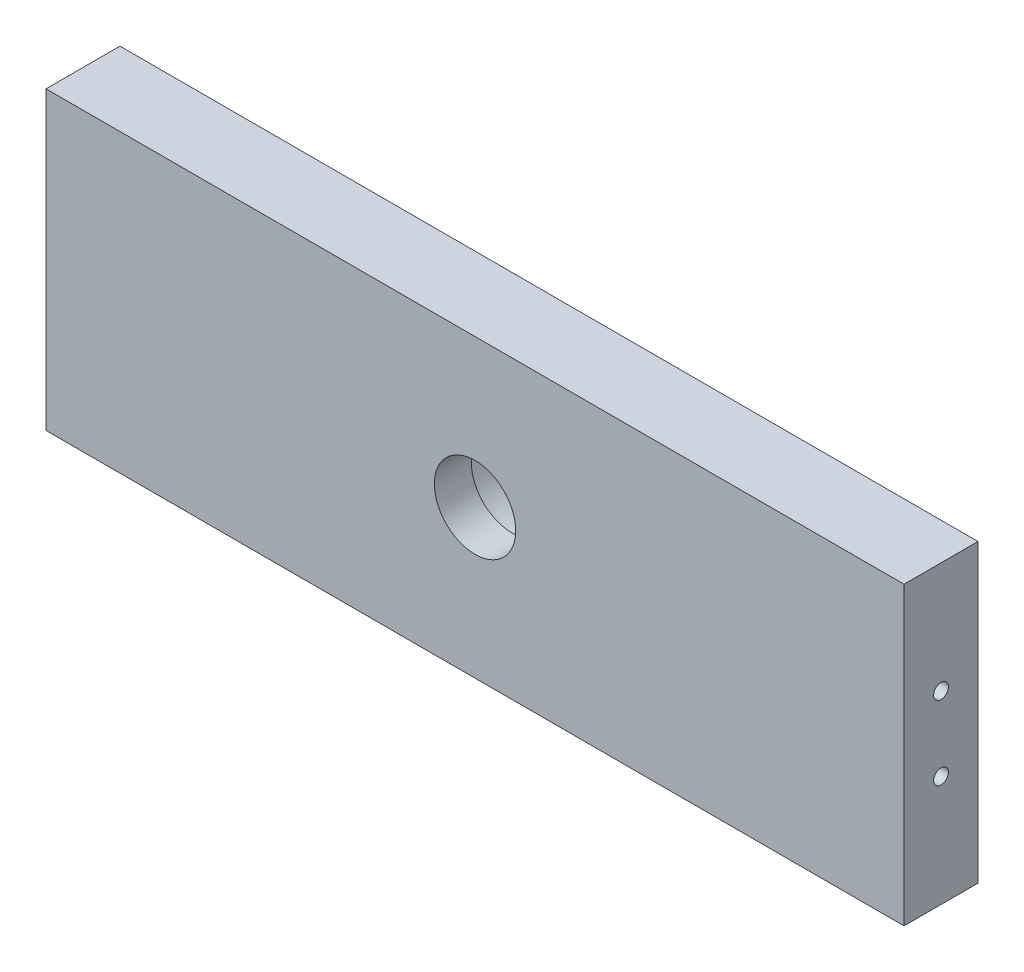
ISO-10303-21;
HEADER;
FILE_DESCRIPTION(('STEP AP214'),'2;1');
FILE_NAME('part.step','',(''),(''),'','','');
FILE_SCHEMA(('AUTOMOTIVE_DESIGN { 1 0 10303 214 1 1 1 1 }'));
ENDSEC;
DATA;
#1=APPLICATION_CONTEXT('core data for automotive mechanical design processes');
#2=APPLICATION_PROTOCOL_DEFINITION('international standard','automotive_design',2000,#1);
#3=PRODUCT_CONTEXT('',#1,'mechanical');
#4=PRODUCT('Part','Part','',(#3));
#5=PRODUCT_RELATED_PRODUCT_CATEGORY('part','',(#4));
#6=PRODUCT_DEFINITION_FORMATION('','',#4);
#7=PRODUCT_DEFINITION_CONTEXT('part definition',#1,'design');
#8=PRODUCT_DEFINITION('design','',#6,#7);
#9=PRODUCT_DEFINITION_SHAPE('','',#8);
#10=(LENGTH_UNIT() NAMED_UNIT(*) SI_UNIT(.MILLI.,.METRE.));
#11=(NAMED_UNIT(*) PLANE_ANGLE_UNIT() SI_UNIT($,.RADIAN.));
#12=(NAMED_UNIT(*) SI_UNIT($,.STERADIAN.) SOLID_ANGLE_UNIT());
#13=UNCERTAINTY_MEASURE_WITH_UNIT(LENGTH_MEASURE(1.E-05),#10,'distance_accuracy_value','');
#14=(GEOMETRIC_REPRESENTATION_CONTEXT(3) GLOBAL_UNCERTAINTY_ASSIGNED_CONTEXT((#13)) GLOBAL_UNIT_ASSIGNED_CONTEXT((#10,
#11,#12)) REPRESENTATION_CONTEXT('',''));
#15=CARTESIAN_POINT('',(0.,0.,0.));
#16=DIRECTION('',(0.,0.,1.));
#17=DIRECTION('',(1.,0.,0.));
#18=AXIS2_PLACEMENT_3D('',#15,#16,#17);
#19=CARTESIAN_POINT('',(-58.,0.,10.));
#20=DIRECTION('',(1.,0.,0.));
#21=DIRECTION('',(0.,1.,0.));
#22=AXIS2_PLACEMENT_3D('',#19,#20,#21);
#23=PLANE('',#22);
#24=DIRECTION('',(0.,-1.,0.));
#25=VECTOR('',#24,1.);
#26=CARTESIAN_POINT('',(-58.,0.,0.));
#27=LINE('',#26,#25);
#28=CARTESIAN_POINT('',(-58.,20.,0.));
#29=VERTEX_POINT('',#28);
#30=CARTESIAN_POINT('',(-58.,-20.,0.));
#31=VERTEX_POINT('',#30);
#32=EDGE_CURVE('E108',#29,#31,#27,.T.);
#33=ORIENTED_EDGE('',*,*,#32,.T.);
#34=DIRECTION('',(0.,0.,-1.));
#35=VECTOR('',#34,1.);
#36=CARTESIAN_POINT('',(-58.,-20.,10.));
#37=LINE('',#36,#35);
#38=CARTESIAN_POINT('',(-58.,-20.,10.));
#39=VERTEX_POINT('',#38);
#40=EDGE_CURVE('E90',#39,#31,#37,.T.);
#41=ORIENTED_EDGE('',*,*,#40,.F.);
#42=DIRECTION('',(0.,-1.,0.));
#43=VECTOR('',#42,1.);
#44=CARTESIAN_POINT('',(-58.,0.,10.));
#45=LINE('',#44,#43);
#46=CARTESIAN_POINT('',(-58.,20.,10.));
#47=VERTEX_POINT('',#46);
#48=EDGE_CURVE('E93',#47,#39,#45,.T.);
#49=ORIENTED_EDGE('',*,*,#48,.F.);
#50=DIRECTION('',(0.,0.,-1.));
#51=VECTOR('',#50,1.);
#52=CARTESIAN_POINT('',(-58.,20.,10.));
#53=LINE('',#52,#51);
#54=EDGE_CURVE('E44',#47,#29,#53,.T.);
#55=ORIENTED_EDGE('',*,*,#54,.T.);
#56=EDGE_LOOP('',(#33,#41,#49,#55));
#57=FACE_BOUND('',#56,.T.);
#58=CARTESIAN_POINT('',(-58.,-5.00000000000001,5.));
#59=DIRECTION('',(-1.,0.,0.));
#60=DIRECTION('',(0.,0.,1.));
#61=AXIS2_PLACEMENT_3D('',#58,#59,#60);
#62=CIRCLE('',#61,1.);
#63=CARTESIAN_POINT('',(-58.,-5.00000000000001,6.));
#64=VERTEX_POINT('',#63);
#65=EDGE_CURVE('E165',#64,#64,#62,.F.);
#66=ORIENTED_EDGE('',*,*,#65,.T.);
#67=EDGE_LOOP('',(#66));
#68=FACE_BOUND('',#67,.T.);
#69=CARTESIAN_POINT('',(-58.,4.99999999999999,5.));
#70=DIRECTION('',(-1.,0.,0.));
#71=DIRECTION('',(0.,0.,1.));
#72=AXIS2_PLACEMENT_3D('',#69,#70,#71);
#73=CIRCLE('',#72,1.);
#74=CARTESIAN_POINT('',(-58.,4.99999999999999,6.));
#75=VERTEX_POINT('',#74);
#76=EDGE_CURVE('E179',#75,#75,#73,.T.);
#77=ORIENTED_EDGE('',*,*,#76,.F.);
#78=EDGE_LOOP('',(#77));
#79=FACE_BOUND('',#78,.T.);
#80=ADVANCED_FACE('F34',(#57,#68,#79),#23,.F.);
#81=CARTESIAN_POINT('',(58.,0.,10.));
#82=DIRECTION('',(1.,0.,0.));
#83=DIRECTION('',(0.,1.,0.));
#84=AXIS2_PLACEMENT_3D('',#81,#82,#83);
#85=PLANE('',#84);
#86=DIRECTION('',(0.,-1.,0.));
#87=VECTOR('',#86,1.);
#88=CARTESIAN_POINT('',(58.,0.,0.));
#89=LINE('',#88,#87);
#90=CARTESIAN_POINT('',(58.,20.,0.));
#91=VERTEX_POINT('',#90);
#92=CARTESIAN_POINT('',(58.,-20.,0.));
#93=VERTEX_POINT('',#92);
#94=EDGE_CURVE('E104',#91,#93,#89,.T.);
#95=ORIENTED_EDGE('',*,*,#94,.F.);
#96=DIRECTION('',(0.,0.,-1.));
#97=VECTOR('',#96,1.);
#98=CARTESIAN_POINT('',(58.,20.,10.));
#99=LINE('',#98,#97);
#100=CARTESIAN_POINT('',(58.,20.,10.));
#101=VERTEX_POINT('',#100);
#102=EDGE_CURVE('E11',#101,#91,#99,.T.);
#103=ORIENTED_EDGE('',*,*,#102,.F.);
#104=DIRECTION('',(0.,-1.,0.));
#105=VECTOR('',#104,1.);
#106=CARTESIAN_POINT('',(58.,0.,10.));
#107=LINE('',#106,#105);
#108=CARTESIAN_POINT('',(58.,-20.,10.));
#109=VERTEX_POINT('',#108);
#110=EDGE_CURVE('E97',#101,#109,#107,.T.);
#111=ORIENTED_EDGE('',*,*,#110,.T.);
#112=DIRECTION('',(0.,0.,-1.));
#113=VECTOR('',#112,1.);
#114=CARTESIAN_POINT('',(58.,-20.,10.));
#115=LINE('',#114,#113);
#116=EDGE_CURVE('E75',#109,#93,#115,.T.);
#117=ORIENTED_EDGE('',*,*,#116,.T.);
#118=EDGE_LOOP('',(#95,#103,#111,#117));
#119=FACE_BOUND('',#118,.T.);
#120=CARTESIAN_POINT('',(58.,5.00000000000001,5.));
#121=DIRECTION('',(1.,0.,0.));
#122=DIRECTION('',(0.,0.,-1.));
#123=AXIS2_PLACEMENT_3D('',#120,#121,#122);
#124=CIRCLE('',#123,1.);
#125=CARTESIAN_POINT('',(58.,5.00000000000001,4.));
#126=VERTEX_POINT('',#125);
#127=EDGE_CURVE('E121',#126,#126,#124,.T.);
#128=ORIENTED_EDGE('',*,*,#127,.F.);
#129=EDGE_LOOP('',(#128));
#130=FACE_BOUND('',#129,.T.);
#131=CARTESIAN_POINT('',(58.,-4.99999999999999,5.));
#132=DIRECTION('',(1.,0.,0.));
#133=DIRECTION('',(0.,0.,-1.));
#134=AXIS2_PLACEMENT_3D('',#131,#132,#133);
#135=CIRCLE('',#134,1.);
#136=CARTESIAN_POINT('',(58.,-4.99999999999999,4.));
#137=VERTEX_POINT('',#136);
#138=EDGE_CURVE('E124',#137,#137,#135,.F.);
#139=ORIENTED_EDGE('',*,*,#138,.T.);
#140=EDGE_LOOP('',(#139));
#141=FACE_BOUND('',#140,.T.);
#142=ADVANCED_FACE('F115',(#119,#130,#141),#85,.T.);
#143=CARTESIAN_POINT('',(0.,20.,10.));
#144=DIRECTION('',(0.,1.,0.));
#145=DIRECTION('',(0.,0.,1.));
#146=AXIS2_PLACEMENT_3D('',#143,#144,#145);
#147=PLANE('',#146);
#148=DIRECTION('',(1.,0.,0.));
#149=VECTOR('',#148,1.);
#150=CARTESIAN_POINT('',(0.,20.,0.));
#151=LINE('',#150,#149);
#152=EDGE_CURVE('E87',#29,#91,#151,.T.);
#153=ORIENTED_EDGE('',*,*,#152,.F.);
#154=ORIENTED_EDGE('',*,*,#54,.F.);
#155=DIRECTION('',(1.,0.,0.));
#156=VECTOR('',#155,1.);
#157=CARTESIAN_POINT('',(0.,20.,10.));
#158=LINE('',#157,#156);
#159=EDGE_CURVE('E85',#47,#101,#158,.T.);
#160=ORIENTED_EDGE('',*,*,#159,.T.);
#161=ORIENTED_EDGE('',*,*,#102,.T.);
#162=EDGE_LOOP('',(#153,#154,#160,#161));
#163=FACE_BOUND('',#162,.T.);
#164=ADVANCED_FACE('F83',(#163),#147,.T.);
#165=CARTESIAN_POINT('',(0.,0.,10.));
#166=DIRECTION('',(0.,0.,-1.));
#167=DIRECTION('',(-1.,0.,0.));
#168=AXIS2_PLACEMENT_3D('',#165,#166,#167);
#169=CYLINDRICAL_SURFACE('',#168,5.5);
#170=CARTESIAN_POINT('',(0.,0.,5.));
#171=DIRECTION('',(0.,0.,1.));
#172=DIRECTION('',(1.,0.,0.));
#173=AXIS2_PLACEMENT_3D('',#170,#171,#172);
#174=CIRCLE('',#173,5.5);
#175=CARTESIAN_POINT('',(5.5,0.,5.));
#176=VERTEX_POINT('',#175);
#177=EDGE_CURVE('E38',#176,#176,#174,.T.);
#178=ORIENTED_EDGE('',*,*,#177,.F.);
#179=EDGE_LOOP('',(#178));
#180=FACE_BOUND('',#179,.T.);
#181=CARTESIAN_POINT('',(0.,0.,10.));
#182=DIRECTION('',(0.,0.,1.));
#183=DIRECTION('',(1.,0.,0.));
#184=AXIS2_PLACEMENT_3D('',#181,#182,#183);
#185=CIRCLE('',#184,5.5);
#186=CARTESIAN_POINT('',(5.5,0.,10.));
#187=VERTEX_POINT('',#186);
#188=EDGE_CURVE('E99',#187,#187,#185,.T.);
#189=ORIENTED_EDGE('',*,*,#188,.T.);
#190=EDGE_LOOP('',(#189));
#191=FACE_BOUND('',#190,.T.);
#192=ADVANCED_FACE('F36',(#180,#191),#169,.F.);
#193=CARTESIAN_POINT('',(0.,-20.,10.));
#194=DIRECTION('',(0.,1.,0.));
#195=DIRECTION('',(0.,0.,1.));
#196=AXIS2_PLACEMENT_3D('',#193,#194,#195);
#197=PLANE('',#196);
#198=DIRECTION('',(1.,0.,0.));
#199=VECTOR('',#198,1.);
#200=CARTESIAN_POINT('',(0.,-20.,0.));
#201=LINE('',#200,#199);
#202=EDGE_CURVE('E68',#31,#93,#201,.T.);
#203=ORIENTED_EDGE('',*,*,#202,.T.);
#204=ORIENTED_EDGE('',*,*,#116,.F.);
#205=DIRECTION('',(1.,0.,0.));
#206=VECTOR('',#205,1.);
#207=CARTESIAN_POINT('',(0.,-20.,10.));
#208=LINE('',#207,#206);
#209=EDGE_CURVE('E52',#39,#109,#208,.T.);
#210=ORIENTED_EDGE('',*,*,#209,.F.);
#211=ORIENTED_EDGE('',*,*,#40,.T.);
#212=EDGE_LOOP('',(#203,#204,#210,#211));
#213=FACE_BOUND('',#212,.T.);
#214=ADVANCED_FACE('F113',(#213),#197,.F.);
#215=CARTESIAN_POINT('',(0.,0.,10.));
#216=DIRECTION('',(0.,0.,1.));
#217=DIRECTION('',(1.,0.,0.));
#218=AXIS2_PLACEMENT_3D('',#215,#216,#217);
#219=PLANE('',#218);
#220=ORIENTED_EDGE('',*,*,#188,.F.);
#221=EDGE_LOOP('',(#220));
#222=FACE_BOUND('',#221,.T.);
#223=ORIENTED_EDGE('',*,*,#110,.F.);
#224=ORIENTED_EDGE('',*,*,#159,.F.);
#225=ORIENTED_EDGE('',*,*,#48,.T.);
#226=ORIENTED_EDGE('',*,*,#209,.T.);
#227=EDGE_LOOP('',(#223,#224,#225,#226));
#228=FACE_BOUND('',#227,.T.);
#229=ADVANCED_FACE('F96',(#222,#228),#219,.T.);
#230=CARTESIAN_POINT('',(0.,0.,0.));
#231=DIRECTION('',(0.,0.,1.));
#232=DIRECTION('',(1.,0.,0.));
#233=AXIS2_PLACEMENT_3D('',#230,#231,#232);
#234=PLANE('',#233);
#235=CARTESIAN_POINT('',(0.,0.,0.));
#236=DIRECTION('',(0.,0.,1.));
#237=DIRECTION('',(1.,0.,0.));
#238=AXIS2_PLACEMENT_3D('',#235,#236,#237);
#239=CIRCLE('',#238,8.05);
#240=CARTESIAN_POINT('',(8.05,0.,0.));
#241=VERTEX_POINT('',#240);
#242=EDGE_CURVE('E170',#241,#241,#239,.T.);
#243=ORIENTED_EDGE('',*,*,#242,.T.);
#244=EDGE_LOOP('',(#243));
#245=FACE_BOUND('',#244,.T.);
#246=ORIENTED_EDGE('',*,*,#94,.T.);
#247=ORIENTED_EDGE('',*,*,#202,.F.);
#248=ORIENTED_EDGE('',*,*,#32,.F.);
#249=ORIENTED_EDGE('',*,*,#152,.T.);
#250=EDGE_LOOP('',(#246,#247,#248,#249));
#251=FACE_BOUND('',#250,.T.);
#252=ADVANCED_FACE('F114',(#245,#251),#234,.F.);
#253=CARTESIAN_POINT('',(48.,5.00000000000001,5.));
#254=DIRECTION('',(1.,0.,0.));
#255=DIRECTION('',(0.,0.,-1.));
#256=AXIS2_PLACEMENT_3D('',#253,#254,#255);
#257=CYLINDRICAL_SURFACE('',#256,1.);
#258=CARTESIAN_POINT('',(48.,5.00000000000001,5.));
#259=DIRECTION('',(1.,0.,0.));
#260=DIRECTION('',(0.,0.,-1.));
#261=AXIS2_PLACEMENT_3D('',#258,#259,#260);
#262=CIRCLE('',#261,1.);
#263=CARTESIAN_POINT('',(48.,5.00000000000001,4.));
#264=VERTEX_POINT('',#263);
#265=EDGE_CURVE('E129',#264,#264,#262,.T.);
#266=ORIENTED_EDGE('',*,*,#265,.F.);
#267=EDGE_LOOP('',(#266));
#268=FACE_BOUND('',#267,.T.);
#269=ORIENTED_EDGE('',*,*,#127,.T.);
#270=EDGE_LOOP('',(#269));
#271=FACE_BOUND('',#270,.T.);
#272=ADVANCED_FACE('F145',(#268,#271),#257,.F.);
#273=CARTESIAN_POINT('',(48.,5.00000000000001,5.));
#274=DIRECTION('',(1.,0.,0.));
#275=DIRECTION('',(0.,0.,-1.));
#276=AXIS2_PLACEMENT_3D('',#273,#274,#275);
#277=PLANE('',#276);
#278=ORIENTED_EDGE('',*,*,#265,.T.);
#279=EDGE_LOOP('',(#278));
#280=FACE_BOUND('',#279,.T.);
#281=ADVANCED_FACE('F209',(#280),#277,.T.);
#282=CARTESIAN_POINT('',(48.,-4.99999999999999,5.));
#283=DIRECTION('',(1.,0.,0.));
#284=DIRECTION('',(0.,0.,-1.));
#285=AXIS2_PLACEMENT_3D('',#282,#283,#284);
#286=CYLINDRICAL_SURFACE('',#285,1.);
#287=CARTESIAN_POINT('',(48.,-4.99999999999999,5.));
#288=DIRECTION('',(1.,0.,0.));
#289=DIRECTION('',(0.,0.,-1.));
#290=AXIS2_PLACEMENT_3D('',#287,#288,#289);
#291=CIRCLE('',#290,1.);
#292=CARTESIAN_POINT('',(48.,-4.99999999999999,4.));
#293=VERTEX_POINT('',#292);
#294=EDGE_CURVE('E106',#293,#293,#291,.F.);
#295=ORIENTED_EDGE('',*,*,#294,.T.);
#296=EDGE_LOOP('',(#295));
#297=FACE_BOUND('',#296,.T.);
#298=ORIENTED_EDGE('',*,*,#138,.F.);
#299=EDGE_LOOP('',(#298));
#300=FACE_BOUND('',#299,.T.);
#301=ADVANCED_FACE('F205',(#297,#300),#286,.F.);
#302=CARTESIAN_POINT('',(48.,0.,0.));
#303=DIRECTION('',(1.,0.,0.));
#304=DIRECTION('',(0.,0.,-1.));
#305=AXIS2_PLACEMENT_3D('',#302,#303,#304);
#306=PLANE('',#305);
#307=ORIENTED_EDGE('',*,*,#294,.F.);
#308=EDGE_LOOP('',(#307));
#309=FACE_BOUND('',#308,.T.);
#310=ADVANCED_FACE('F199',(#309),#306,.T.);
#311=CARTESIAN_POINT('',(-48.,-5.00000000000001,5.));
#312=DIRECTION('',(-1.,0.,0.));
#313=DIRECTION('',(0.,-1.,0.));
#314=AXIS2_PLACEMENT_3D('',#311,#312,#313);
#315=CYLINDRICAL_SURFACE('',#314,1.);
#316=CARTESIAN_POINT('',(-48.,-5.00000000000001,5.));
#317=DIRECTION('',(-1.,0.,0.));
#318=DIRECTION('',(0.,0.,1.));
#319=AXIS2_PLACEMENT_3D('',#316,#317,#318);
#320=CIRCLE('',#319,1.);
#321=CARTESIAN_POINT('',(-48.,-5.00000000000001,6.));
#322=VERTEX_POINT('',#321);
#323=EDGE_CURVE('E168',#322,#322,#320,.F.);
#324=ORIENTED_EDGE('',*,*,#323,.T.);
#325=EDGE_LOOP('',(#324));
#326=FACE_BOUND('',#325,.T.);
#327=ORIENTED_EDGE('',*,*,#65,.F.);
#328=EDGE_LOOP('',(#327));
#329=FACE_BOUND('',#328,.T.);
#330=ADVANCED_FACE('F185',(#326,#329),#315,.F.);
#331=CARTESIAN_POINT('',(-48.,0.,0.));
#332=DIRECTION('',(-1.,0.,0.));
#333=DIRECTION('',(0.,0.,1.));
#334=AXIS2_PLACEMENT_3D('',#331,#332,#333);
#335=PLANE('',#334);
#336=ORIENTED_EDGE('',*,*,#323,.F.);
#337=EDGE_LOOP('',(#336));
#338=FACE_BOUND('',#337,.T.);
#339=ADVANCED_FACE('F188',(#338),#335,.T.);
#340=CARTESIAN_POINT('',(-48.,4.99999999999999,5.));
#341=DIRECTION('',(-1.,0.,0.));
#342=DIRECTION('',(0.,-1.,0.));
#343=AXIS2_PLACEMENT_3D('',#340,#341,#342);
#344=CYLINDRICAL_SURFACE('',#343,1.);
#345=CARTESIAN_POINT('',(-48.,4.99999999999999,5.));
#346=DIRECTION('',(-1.,0.,0.));
#347=DIRECTION('',(0.,0.,1.));
#348=AXIS2_PLACEMENT_3D('',#345,#346,#347);
#349=CIRCLE('',#348,1.);
#350=CARTESIAN_POINT('',(-48.,4.99999999999999,6.));
#351=VERTEX_POINT('',#350);
#352=EDGE_CURVE('E134',#351,#351,#349,.T.);
#353=ORIENTED_EDGE('',*,*,#352,.F.);
#354=EDGE_LOOP('',(#353));
#355=FACE_BOUND('',#354,.T.);
#356=ORIENTED_EDGE('',*,*,#76,.T.);
#357=EDGE_LOOP('',(#356));
#358=FACE_BOUND('',#357,.T.);
#359=ADVANCED_FACE('F190',(#355,#358),#344,.F.);
#360=CARTESIAN_POINT('',(-48.,0.,0.));
#361=DIRECTION('',(-1.,0.,0.));
#362=DIRECTION('',(0.,0.,1.));
#363=AXIS2_PLACEMENT_3D('',#360,#361,#362);
#364=PLANE('',#363);
#365=ORIENTED_EDGE('',*,*,#352,.T.);
#366=EDGE_LOOP('',(#365));
#367=FACE_BOUND('',#366,.T.);
#368=ADVANCED_FACE('F196',(#367),#364,.T.);
#369=CARTESIAN_POINT('',(0.,0.,5.));
#370=DIRECTION('',(0.,0.,-1.));
#371=DIRECTION('',(-1.,0.,0.));
#372=AXIS2_PLACEMENT_3D('',#369,#370,#371);
#373=CYLINDRICAL_SURFACE('',#372,8.05);
#374=CARTESIAN_POINT('',(0.,0.,5.));
#375=DIRECTION('',(0.,0.,1.));
#376=DIRECTION('',(1.,0.,0.));
#377=AXIS2_PLACEMENT_3D('',#374,#375,#376);
#378=CIRCLE('',#377,8.05);
#379=CARTESIAN_POINT('',(8.05,0.,5.));
#380=VERTEX_POINT('',#379);
#381=EDGE_CURVE('E166',#380,#380,#378,.T.);
#382=ORIENTED_EDGE('',*,*,#381,.T.);
#383=EDGE_LOOP('',(#382));
#384=FACE_BOUND('',#383,.T.);
#385=ORIENTED_EDGE('',*,*,#242,.F.);
#386=EDGE_LOOP('',(#385));
#387=FACE_BOUND('',#386,.T.);
#388=ADVANCED_FACE('F253',(#384,#387),#373,.F.);
#389=CARTESIAN_POINT('',(0.,0.,5.));
#390=DIRECTION('',(0.,0.,1.));
#391=DIRECTION('',(1.,0.,0.));
#392=AXIS2_PLACEMENT_3D('',#389,#390,#391);
#393=PLANE('',#392);
#394=ORIENTED_EDGE('',*,*,#177,.T.);
#395=EDGE_LOOP('',(#394));
#396=FACE_BOUND('',#395,.T.);
#397=ORIENTED_EDGE('',*,*,#381,.F.);
#398=EDGE_LOOP('',(#397));
#399=FACE_BOUND('',#398,.T.);
#400=ADVANCED_FACE('F277',(#396,#399),#393,.F.);
#401=CLOSED_SHELL('',(#80,#142,#164,#192,#214,#229,#252,#272,#281,#301,#310,#330,#339,#359,#368,
#388,#400));
#402=MANIFOLD_SOLID_BREP('B2',#401);
#403=ADVANCED_BREP_SHAPE_REPRESENTATION('',(#18,#402),#14);
#404=SHAPE_DEFINITION_REPRESENTATION(#9,#403);
ENDSEC;
END-ISO-10303-21;
